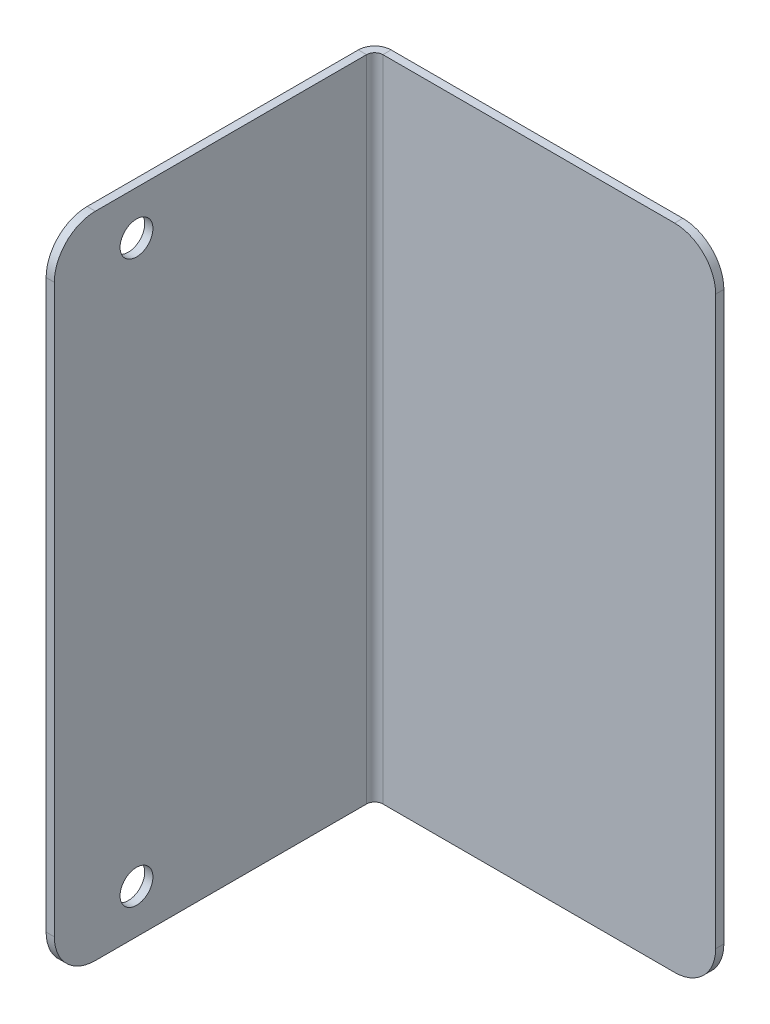
ISO-10303-21;
HEADER;
FILE_DESCRIPTION(('STEP AP214'),'2;1');
FILE_NAME('part.step','',(''),(''),'','','');
FILE_SCHEMA(('AUTOMOTIVE_DESIGN { 1 0 10303 214 1 1 1 1 }'));
ENDSEC;
DATA;
#1=APPLICATION_CONTEXT('core data for automotive mechanical design processes');
#2=APPLICATION_PROTOCOL_DEFINITION('international standard','automotive_design',2000,#1);
#3=PRODUCT_CONTEXT('',#1,'mechanical');
#4=PRODUCT('Part','Part','',(#3));
#5=PRODUCT_RELATED_PRODUCT_CATEGORY('part','',(#4));
#6=PRODUCT_DEFINITION_FORMATION('','',#4);
#7=PRODUCT_DEFINITION_CONTEXT('part definition',#1,'design');
#8=PRODUCT_DEFINITION('design','',#6,#7);
#9=PRODUCT_DEFINITION_SHAPE('','',#8);
#10=(LENGTH_UNIT() NAMED_UNIT(*) SI_UNIT(.MILLI.,.METRE.));
#11=(NAMED_UNIT(*) PLANE_ANGLE_UNIT() SI_UNIT($,.RADIAN.));
#12=(NAMED_UNIT(*) SI_UNIT($,.STERADIAN.) SOLID_ANGLE_UNIT());
#13=UNCERTAINTY_MEASURE_WITH_UNIT(LENGTH_MEASURE(1.E-05),#10,'distance_accuracy_value','');
#14=(GEOMETRIC_REPRESENTATION_CONTEXT(3) GLOBAL_UNCERTAINTY_ASSIGNED_CONTEXT((#13)) GLOBAL_UNIT_ASSIGNED_CONTEXT((#10,
#11,#12)) REPRESENTATION_CONTEXT('',''));
#15=CARTESIAN_POINT('',(0.,0.,0.));
#16=DIRECTION('',(0.,0.,1.));
#17=DIRECTION('',(1.,0.,0.));
#18=AXIS2_PLACEMENT_3D('',#15,#16,#17);
#19=CARTESIAN_POINT('',(254.5,935.,360.));
#20=DIRECTION('',(-1.,0.,0.));
#21=DIRECTION('',(0.,0.,1.));
#22=AXIS2_PLACEMENT_3D('',#19,#20,#21);
#23=CYLINDRICAL_SURFACE('',#22,10.);
#24=DIRECTION('',(1.,0.,0.));
#25=VECTOR('',#24,1.);
#26=CARTESIAN_POINT('',(254.5,945.,360.));
#27=LINE('',#26,#25);
#28=CARTESIAN_POINT('',(252.5,945.,360.));
#29=VERTEX_POINT('',#28);
#30=CARTESIAN_POINT('',(254.5,945.,360.));
#31=VERTEX_POINT('',#30);
#32=EDGE_CURVE('E11',#29,#31,#27,.T.);
#33=ORIENTED_EDGE('',*,*,#32,.F.);
#34=CARTESIAN_POINT('',(252.5,935.,360.));
#35=DIRECTION('',(-1.,0.,0.));
#36=DIRECTION('',(0.,0.,1.));
#37=AXIS2_PLACEMENT_3D('',#34,#35,#36);
#38=CIRCLE('',#37,10.);
#39=CARTESIAN_POINT('',(252.5,935.,370.));
#40=VERTEX_POINT('',#39);
#41=EDGE_CURVE('E97',#29,#40,#38,.F.);
#42=ORIENTED_EDGE('',*,*,#41,.T.);
#43=DIRECTION('',(1.,0.,0.));
#44=VECTOR('',#43,1.);
#45=CARTESIAN_POINT('',(254.5,935.,370.));
#46=LINE('',#45,#44);
#47=CARTESIAN_POINT('',(254.5,935.,370.));
#48=VERTEX_POINT('',#47);
#49=EDGE_CURVE('E47',#40,#48,#46,.T.);
#50=ORIENTED_EDGE('',*,*,#49,.T.);
#51=CARTESIAN_POINT('',(254.5,935.,360.));
#52=DIRECTION('',(-1.,0.,0.));
#53=DIRECTION('',(0.,0.,1.));
#54=AXIS2_PLACEMENT_3D('',#51,#52,#53);
#55=CIRCLE('',#54,10.);
#56=EDGE_CURVE('E100',#31,#48,#55,.F.);
#57=ORIENTED_EDGE('',*,*,#56,.F.);
#58=EDGE_LOOP('',(#33,#42,#50,#57));
#59=FACE_BOUND('',#58,.T.);
#60=ADVANCED_FACE('F37',(#59),#23,.T.);
#61=CARTESIAN_POINT('',(254.5,787.,370.));
#62=DIRECTION('',(0.,0.,1.));
#63=DIRECTION('',(0.,1.,0.));
#64=AXIS2_PLACEMENT_3D('',#61,#62,#63);
#65=PLANE('',#64);
#66=ORIENTED_EDGE('',*,*,#49,.F.);
#67=DIRECTION('',(0.,1.,0.));
#68=VECTOR('',#67,1.);
#69=CARTESIAN_POINT('',(252.5,0.,370.));
#70=LINE('',#69,#68);
#71=CARTESIAN_POINT('',(252.5,797.,370.));
#72=VERTEX_POINT('',#71);
#73=EDGE_CURVE('E113',#72,#40,#70,.T.);
#74=ORIENTED_EDGE('',*,*,#73,.F.);
#75=DIRECTION('',(1.,0.,0.));
#76=VECTOR('',#75,1.);
#77=CARTESIAN_POINT('',(254.5,797.,370.));
#78=LINE('',#77,#76);
#79=CARTESIAN_POINT('',(254.5,797.,370.));
#80=VERTEX_POINT('',#79);
#81=EDGE_CURVE('E150',#72,#80,#78,.T.);
#82=ORIENTED_EDGE('',*,*,#81,.T.);
#83=DIRECTION('',(0.,1.,0.));
#84=VECTOR('',#83,1.);
#85=CARTESIAN_POINT('',(254.5,787.,370.));
#86=LINE('',#85,#84);
#87=EDGE_CURVE('E162',#80,#48,#86,.T.);
#88=ORIENTED_EDGE('',*,*,#87,.T.);
#89=EDGE_LOOP('',(#66,#74,#82,#88));
#90=FACE_BOUND('',#89,.T.);
#91=ADVANCED_FACE('F167',(#90),#65,.T.);
#92=CARTESIAN_POINT('',(254.5,797.,360.));
#93=DIRECTION('',(-1.,0.,0.));
#94=DIRECTION('',(0.,0.,1.));
#95=AXIS2_PLACEMENT_3D('',#92,#93,#94);
#96=CYLINDRICAL_SURFACE('',#95,10.);
#97=ORIENTED_EDGE('',*,*,#81,.F.);
#98=CARTESIAN_POINT('',(252.5,797.,360.));
#99=DIRECTION('',(-1.,0.,0.));
#100=DIRECTION('',(0.,0.,1.));
#101=AXIS2_PLACEMENT_3D('',#98,#99,#100);
#102=CIRCLE('',#101,10.);
#103=CARTESIAN_POINT('',(252.5,787.,360.));
#104=VERTEX_POINT('',#103);
#105=EDGE_CURVE('E212',#72,#104,#102,.F.);
#106=ORIENTED_EDGE('',*,*,#105,.T.);
#107=DIRECTION('',(1.,0.,0.));
#108=VECTOR('',#107,1.);
#109=CARTESIAN_POINT('',(254.5,787.,360.));
#110=LINE('',#109,#108);
#111=CARTESIAN_POINT('',(254.5,787.,360.));
#112=VERTEX_POINT('',#111);
#113=EDGE_CURVE('E147',#104,#112,#110,.T.);
#114=ORIENTED_EDGE('',*,*,#113,.T.);
#115=CARTESIAN_POINT('',(254.5,797.,360.));
#116=DIRECTION('',(-1.,0.,0.));
#117=DIRECTION('',(0.,0.,1.));
#118=AXIS2_PLACEMENT_3D('',#115,#116,#117);
#119=CIRCLE('',#118,10.);
#120=EDGE_CURVE('E168',#80,#112,#119,.F.);
#121=ORIENTED_EDGE('',*,*,#120,.F.);
#122=EDGE_LOOP('',(#97,#106,#114,#121));
#123=FACE_BOUND('',#122,.T.);
#124=ADVANCED_FACE('F215',(#123),#96,.T.);
#125=CARTESIAN_POINT('',(254.5,787.,292.));
#126=DIRECTION('',(0.,-1.,0.));
#127=DIRECTION('',(0.,0.,1.));
#128=AXIS2_PLACEMENT_3D('',#125,#126,#127);
#129=PLANE('',#128);
#130=ORIENTED_EDGE('',*,*,#113,.F.);
#131=DIRECTION('',(0.,0.,1.));
#132=VECTOR('',#131,1.);
#133=CARTESIAN_POINT('',(252.500000000001,787.,8.91380986117316E-13));
#134=LINE('',#133,#132);
#135=CARTESIAN_POINT('',(252.5,787.,294.));
#136=VERTEX_POINT('',#135);
#137=EDGE_CURVE('E190',#136,#104,#134,.T.);
#138=ORIENTED_EDGE('',*,*,#137,.F.);
#139=DIRECTION('',(1.,0.,0.));
#140=VECTOR('',#139,1.);
#141=CARTESIAN_POINT('',(254.5,787.,294.));
#142=LINE('',#141,#140);
#143=CARTESIAN_POINT('',(254.5,787.,294.));
#144=VERTEX_POINT('',#143);
#145=EDGE_CURVE('E145',#136,#144,#142,.T.);
#146=ORIENTED_EDGE('',*,*,#145,.T.);
#147=DIRECTION('',(0.,0.,1.));
#148=VECTOR('',#147,1.);
#149=CARTESIAN_POINT('',(254.5,787.,292.));
#150=LINE('',#149,#148);
#151=EDGE_CURVE('E170',#144,#112,#150,.T.);
#152=ORIENTED_EDGE('',*,*,#151,.T.);
#153=EDGE_LOOP('',(#130,#138,#146,#152));
#154=FACE_BOUND('',#153,.T.);
#155=ADVANCED_FACE('F219',(#154),#129,.T.);
#156=CARTESIAN_POINT('',(256.5,787.,294.));
#157=DIRECTION('',(0.,1.,0.));
#158=DIRECTION('',(0.,0.,1.));
#159=AXIS2_PLACEMENT_3D('',#156,#157,#158);
#160=PLANE('',#159);
#161=ORIENTED_EDGE('',*,*,#145,.F.);
#162=CARTESIAN_POINT('',(256.5,787.,294.));
#163=DIRECTION('',(0.,-1.,0.));
#164=DIRECTION('',(0.,0.,-1.));
#165=AXIS2_PLACEMENT_3D('',#162,#163,#164);
#166=CIRCLE('',#165,4.);
#167=CARTESIAN_POINT('',(256.5,787.,290.));
#168=VERTEX_POINT('',#167);
#169=EDGE_CURVE('E192',#136,#168,#166,.T.);
#170=ORIENTED_EDGE('',*,*,#169,.T.);
#171=DIRECTION('',(0.,0.,1.));
#172=VECTOR('',#171,1.);
#173=CARTESIAN_POINT('',(256.5,787.,292.));
#174=LINE('',#173,#172);
#175=CARTESIAN_POINT('',(256.5,787.,292.));
#176=VERTEX_POINT('',#175);
#177=EDGE_CURVE('E142',#168,#176,#174,.T.);
#178=ORIENTED_EDGE('',*,*,#177,.T.);
#179=CARTESIAN_POINT('',(256.5,787.,294.));
#180=DIRECTION('',(0.,-1.,0.));
#181=DIRECTION('',(0.,0.,-1.));
#182=AXIS2_PLACEMENT_3D('',#179,#180,#181);
#183=CIRCLE('',#182,2.);
#184=EDGE_CURVE('E181',#144,#176,#183,.T.);
#185=ORIENTED_EDGE('',*,*,#184,.F.);
#186=EDGE_LOOP('',(#161,#170,#178,#185));
#187=FACE_BOUND('',#186,.T.);
#188=ADVANCED_FACE('F226',(#187),#160,.F.);
#189=CARTESIAN_POINT('',(252.5,787.,292.));
#190=DIRECTION('',(0.,1.,0.));
#191=DIRECTION('',(-1.,0.,0.));
#192=AXIS2_PLACEMENT_3D('',#189,#190,#191);
#193=PLANE('',#192);
#194=ORIENTED_EDGE('',*,*,#177,.F.);
#195=DIRECTION('',(1.,0.,0.));
#196=VECTOR('',#195,1.);
#197=CARTESIAN_POINT('',(0.,787.,290.));
#198=LINE('',#197,#196);
#199=CARTESIAN_POINT('',(327.5,787.,290.));
#200=VERTEX_POINT('',#199);
#201=EDGE_CURVE('E204',#200,#168,#198,.F.);
#202=ORIENTED_EDGE('',*,*,#201,.F.);
#203=DIRECTION('',(0.,0.,1.));
#204=VECTOR('',#203,1.);
#205=CARTESIAN_POINT('',(327.5,787.,292.));
#206=LINE('',#205,#204);
#207=CARTESIAN_POINT('',(327.5,787.,292.));
#208=VERTEX_POINT('',#207);
#209=EDGE_CURVE('E139',#200,#208,#206,.T.);
#210=ORIENTED_EDGE('',*,*,#209,.T.);
#211=DIRECTION('',(-1.,0.,0.));
#212=VECTOR('',#211,1.);
#213=CARTESIAN_POINT('',(252.5,787.,292.));
#214=LINE('',#213,#212);
#215=EDGE_CURVE('E209',#208,#176,#214,.T.);
#216=ORIENTED_EDGE('',*,*,#215,.T.);
#217=EDGE_LOOP('',(#194,#202,#210,#216));
#218=FACE_BOUND('',#217,.T.);
#219=ADVANCED_FACE('F250',(#218),#193,.F.);
#220=CARTESIAN_POINT('',(327.5,797.,292.));
#221=DIRECTION('',(0.,0.,1.));
#222=DIRECTION('',(1.,0.,0.));
#223=AXIS2_PLACEMENT_3D('',#220,#221,#222);
#224=CYLINDRICAL_SURFACE('',#223,10.);
#225=ORIENTED_EDGE('',*,*,#209,.F.);
#226=CARTESIAN_POINT('',(327.5,797.,290.));
#227=DIRECTION('',(0.,0.,1.));
#228=DIRECTION('',(1.,0.,0.));
#229=AXIS2_PLACEMENT_3D('',#226,#227,#228);
#230=CIRCLE('',#229,10.);
#231=CARTESIAN_POINT('',(337.5,797.,290.));
#232=VERTEX_POINT('',#231);
#233=EDGE_CURVE('E201',#200,#232,#230,.T.);
#234=ORIENTED_EDGE('',*,*,#233,.T.);
#235=DIRECTION('',(0.,0.,1.));
#236=VECTOR('',#235,1.);
#237=CARTESIAN_POINT('',(337.5,797.,292.));
#238=LINE('',#237,#236);
#239=CARTESIAN_POINT('',(337.5,797.,292.));
#240=VERTEX_POINT('',#239);
#241=EDGE_CURVE('E136',#232,#240,#238,.T.);
#242=ORIENTED_EDGE('',*,*,#241,.T.);
#243=CARTESIAN_POINT('',(327.5,797.,292.));
#244=DIRECTION('',(0.,0.,1.));
#245=DIRECTION('',(1.,0.,0.));
#246=AXIS2_PLACEMENT_3D('',#243,#244,#245);
#247=CIRCLE('',#246,10.);
#248=EDGE_CURVE('E258',#208,#240,#247,.T.);
#249=ORIENTED_EDGE('',*,*,#248,.F.);
#250=EDGE_LOOP('',(#225,#234,#242,#249));
#251=FACE_BOUND('',#250,.T.);
#252=ADVANCED_FACE('F263',(#251),#224,.T.);
#253=CARTESIAN_POINT('',(337.5,945.,292.));
#254=DIRECTION('',(-1.,0.,0.));
#255=DIRECTION('',(0.,-1.,0.));
#256=AXIS2_PLACEMENT_3D('',#253,#254,#255);
#257=PLANE('',#256);
#258=ORIENTED_EDGE('',*,*,#241,.F.);
#259=DIRECTION('',(0.,1.,0.));
#260=VECTOR('',#259,1.);
#261=CARTESIAN_POINT('',(337.5,0.,290.));
#262=LINE('',#261,#260);
#263=CARTESIAN_POINT('',(337.5,935.,290.));
#264=VERTEX_POINT('',#263);
#265=EDGE_CURVE('E198',#264,#232,#262,.F.);
#266=ORIENTED_EDGE('',*,*,#265,.F.);
#267=DIRECTION('',(0.,0.,1.));
#268=VECTOR('',#267,1.);
#269=CARTESIAN_POINT('',(337.5,935.,292.));
#270=LINE('',#269,#268);
#271=CARTESIAN_POINT('',(337.5,935.,292.));
#272=VERTEX_POINT('',#271);
#273=EDGE_CURVE('E133',#264,#272,#270,.T.);
#274=ORIENTED_EDGE('',*,*,#273,.T.);
#275=DIRECTION('',(0.,-1.,0.));
#276=VECTOR('',#275,1.);
#277=CARTESIAN_POINT('',(337.5,945.,292.));
#278=LINE('',#277,#276);
#279=EDGE_CURVE('E264',#272,#240,#278,.T.);
#280=ORIENTED_EDGE('',*,*,#279,.T.);
#281=EDGE_LOOP('',(#258,#266,#274,#280));
#282=FACE_BOUND('',#281,.T.);
#283=ADVANCED_FACE('F335',(#282),#257,.F.);
#284=CARTESIAN_POINT('',(327.5,935.,292.));
#285=DIRECTION('',(0.,0.,1.));
#286=DIRECTION('',(1.,0.,0.));
#287=AXIS2_PLACEMENT_3D('',#284,#285,#286);
#288=CYLINDRICAL_SURFACE('',#287,10.);
#289=ORIENTED_EDGE('',*,*,#273,.F.);
#290=CARTESIAN_POINT('',(327.5,935.,290.));
#291=DIRECTION('',(0.,0.,1.));
#292=DIRECTION('',(1.,0.,0.));
#293=AXIS2_PLACEMENT_3D('',#290,#291,#292);
#294=CIRCLE('',#293,10.);
#295=CARTESIAN_POINT('',(327.5,945.,290.));
#296=VERTEX_POINT('',#295);
#297=EDGE_CURVE('E195',#264,#296,#294,.T.);
#298=ORIENTED_EDGE('',*,*,#297,.T.);
#299=DIRECTION('',(0.,0.,1.));
#300=VECTOR('',#299,1.);
#301=CARTESIAN_POINT('',(327.5,945.,292.));
#302=LINE('',#301,#300);
#303=CARTESIAN_POINT('',(327.5,945.,292.));
#304=VERTEX_POINT('',#303);
#305=EDGE_CURVE('E130',#296,#304,#302,.T.);
#306=ORIENTED_EDGE('',*,*,#305,.T.);
#307=CARTESIAN_POINT('',(327.5,935.,292.));
#308=DIRECTION('',(0.,0.,1.));
#309=DIRECTION('',(1.,0.,0.));
#310=AXIS2_PLACEMENT_3D('',#307,#308,#309);
#311=CIRCLE('',#310,10.);
#312=EDGE_CURVE('E266',#272,#304,#311,.T.);
#313=ORIENTED_EDGE('',*,*,#312,.F.);
#314=EDGE_LOOP('',(#289,#298,#306,#313));
#315=FACE_BOUND('',#314,.T.);
#316=ADVANCED_FACE('F331',(#315),#288,.T.);
#317=CARTESIAN_POINT('',(252.5,945.,292.));
#318=DIRECTION('',(0.,-1.,0.));
#319=DIRECTION('',(1.,0.,0.));
#320=AXIS2_PLACEMENT_3D('',#317,#318,#319);
#321=PLANE('',#320);
#322=ORIENTED_EDGE('',*,*,#305,.F.);
#323=DIRECTION('',(1.,0.,0.));
#324=VECTOR('',#323,1.);
#325=CARTESIAN_POINT('',(0.,945.,290.));
#326=LINE('',#325,#324);
#327=CARTESIAN_POINT('',(256.5,945.,290.));
#328=VERTEX_POINT('',#327);
#329=EDGE_CURVE('E186',#328,#296,#326,.T.);
#330=ORIENTED_EDGE('',*,*,#329,.F.);
#331=DIRECTION('',(0.,0.,1.));
#332=VECTOR('',#331,1.);
#333=CARTESIAN_POINT('',(256.5,945.,292.));
#334=LINE('',#333,#332);
#335=CARTESIAN_POINT('',(256.5,945.,292.));
#336=VERTEX_POINT('',#335);
#337=EDGE_CURVE('E127',#328,#336,#334,.T.);
#338=ORIENTED_EDGE('',*,*,#337,.T.);
#339=DIRECTION('',(1.,0.,0.));
#340=VECTOR('',#339,1.);
#341=CARTESIAN_POINT('',(252.5,945.,292.));
#342=LINE('',#341,#340);
#343=EDGE_CURVE('E271',#336,#304,#342,.T.);
#344=ORIENTED_EDGE('',*,*,#343,.T.);
#345=EDGE_LOOP('',(#322,#330,#338,#344));
#346=FACE_BOUND('',#345,.T.);
#347=ADVANCED_FACE('F311',(#346),#321,.F.);
#348=CARTESIAN_POINT('',(256.5,945.,294.));
#349=DIRECTION('',(0.,1.,0.));
#350=DIRECTION('',(0.,0.,1.));
#351=AXIS2_PLACEMENT_3D('',#348,#349,#350);
#352=PLANE('',#351);
#353=ORIENTED_EDGE('',*,*,#337,.F.);
#354=CARTESIAN_POINT('',(256.5,945.,294.));
#355=DIRECTION('',(0.,-1.,0.));
#356=DIRECTION('',(0.,0.,-1.));
#357=AXIS2_PLACEMENT_3D('',#354,#355,#356);
#358=CIRCLE('',#357,4.);
#359=CARTESIAN_POINT('',(252.5,945.,294.));
#360=VERTEX_POINT('',#359);
#361=EDGE_CURVE('E189',#328,#360,#358,.F.);
#362=ORIENTED_EDGE('',*,*,#361,.T.);
#363=DIRECTION('',(1.,0.,0.));
#364=VECTOR('',#363,1.);
#365=CARTESIAN_POINT('',(254.5,945.,294.));
#366=LINE('',#365,#364);
#367=CARTESIAN_POINT('',(254.5,945.,294.));
#368=VERTEX_POINT('',#367);
#369=EDGE_CURVE('E41',#360,#368,#366,.T.);
#370=ORIENTED_EDGE('',*,*,#369,.T.);
#371=CARTESIAN_POINT('',(256.5,945.,294.));
#372=DIRECTION('',(0.,-1.,0.));
#373=DIRECTION('',(0.,0.,-1.));
#374=AXIS2_PLACEMENT_3D('',#371,#372,#373);
#375=CIRCLE('',#374,2.);
#376=EDGE_CURVE('E179',#336,#368,#375,.F.);
#377=ORIENTED_EDGE('',*,*,#376,.F.);
#378=EDGE_LOOP('',(#353,#362,#370,#377));
#379=FACE_BOUND('',#378,.T.);
#380=ADVANCED_FACE('F305',(#379),#352,.T.);
#381=CARTESIAN_POINT('',(254.5,934.35,350.));
#382=DIRECTION('',(-1.,0.,0.));
#383=DIRECTION('',(0.,0.,1.));
#384=AXIS2_PLACEMENT_3D('',#381,#382,#383);
#385=CYLINDRICAL_SURFACE('',#384,3.99999999999999);
#386=CARTESIAN_POINT('',(254.5,934.35,350.));
#387=DIRECTION('',(1.,0.,0.));
#388=DIRECTION('',(0.,0.,-1.));
#389=AXIS2_PLACEMENT_3D('',#386,#387,#388);
#390=CIRCLE('',#389,3.99999999999999);
#391=CARTESIAN_POINT('',(254.5,934.35,346.));
#392=VERTEX_POINT('',#391);
#393=EDGE_CURVE('E275',#392,#392,#390,.T.);
#394=ORIENTED_EDGE('',*,*,#393,.T.);
#395=EDGE_LOOP('',(#394));
#396=FACE_BOUND('',#395,.T.);
#397=CARTESIAN_POINT('',(252.5,934.35,350.));
#398=DIRECTION('',(1.,0.,0.));
#399=DIRECTION('',(0.,0.,-1.));
#400=AXIS2_PLACEMENT_3D('',#397,#398,#399);
#401=CIRCLE('',#400,3.99999999999999);
#402=CARTESIAN_POINT('',(252.5,934.35,346.));
#403=VERTEX_POINT('',#402);
#404=EDGE_CURVE('E120',#403,#403,#401,.T.);
#405=ORIENTED_EDGE('',*,*,#404,.F.);
#406=EDGE_LOOP('',(#405));
#407=FACE_BOUND('',#406,.T.);
#408=ADVANCED_FACE('F303',(#396,#407),#385,.F.);
#409=CARTESIAN_POINT('',(254.5,797.65,350.));
#410=DIRECTION('',(-1.,0.,0.));
#411=DIRECTION('',(0.,0.,1.));
#412=AXIS2_PLACEMENT_3D('',#409,#410,#411);
#413=CYLINDRICAL_SURFACE('',#412,3.99999999999999);
#414=CARTESIAN_POINT('',(254.5,797.65,350.));
#415=DIRECTION('',(1.,0.,0.));
#416=DIRECTION('',(0.,0.,-1.));
#417=AXIS2_PLACEMENT_3D('',#414,#415,#416);
#418=CIRCLE('',#417,3.99999999999999);
#419=CARTESIAN_POINT('',(254.5,797.65,346.));
#420=VERTEX_POINT('',#419);
#421=EDGE_CURVE('E278',#420,#420,#418,.T.);
#422=ORIENTED_EDGE('',*,*,#421,.T.);
#423=EDGE_LOOP('',(#422));
#424=FACE_BOUND('',#423,.T.);
#425=CARTESIAN_POINT('',(252.5,797.65,350.));
#426=DIRECTION('',(1.,0.,0.));
#427=DIRECTION('',(0.,0.,-1.));
#428=AXIS2_PLACEMENT_3D('',#425,#426,#427);
#429=CIRCLE('',#428,3.99999999999999);
#430=CARTESIAN_POINT('',(252.5,797.65,346.));
#431=VERTEX_POINT('',#430);
#432=EDGE_CURVE('E117',#431,#431,#429,.T.);
#433=ORIENTED_EDGE('',*,*,#432,.F.);
#434=EDGE_LOOP('',(#433));
#435=FACE_BOUND('',#434,.T.);
#436=ADVANCED_FACE('F39',(#424,#435),#413,.F.);
#437=CARTESIAN_POINT('',(254.5,945.,370.));
#438=DIRECTION('',(0.,1.,0.));
#439=DIRECTION('',(0.,0.,-1.));
#440=AXIS2_PLACEMENT_3D('',#437,#438,#439);
#441=PLANE('',#440);
#442=DIRECTION('',(0.,0.,1.));
#443=VECTOR('',#442,1.);
#444=CARTESIAN_POINT('',(252.500000000001,945.,8.91380986117316E-13));
#445=LINE('',#444,#443);
#446=EDGE_CURVE('E110',#29,#360,#445,.F.);
#447=ORIENTED_EDGE('',*,*,#446,.F.);
#448=ORIENTED_EDGE('',*,*,#32,.T.);
#449=DIRECTION('',(0.,0.,-1.));
#450=VECTOR('',#449,1.);
#451=CARTESIAN_POINT('',(254.5,945.,370.));
#452=LINE('',#451,#450);
#453=EDGE_CURVE('E165',#31,#368,#452,.T.);
#454=ORIENTED_EDGE('',*,*,#453,.T.);
#455=ORIENTED_EDGE('',*,*,#369,.F.);
#456=EDGE_LOOP('',(#447,#448,#454,#455));
#457=FACE_BOUND('',#456,.T.);
#458=ADVANCED_FACE('F115',(#457),#441,.T.);
#459=CARTESIAN_POINT('',(256.5,787.,294.));
#460=DIRECTION('',(0.,-1.,0.));
#461=DIRECTION('',(-1.,0.,0.));
#462=AXIS2_PLACEMENT_3D('',#459,#460,#461);
#463=CYLINDRICAL_SURFACE('',#462,2.);
#464=DIRECTION('',(0.,-1.,0.));
#465=VECTOR('',#464,1.);
#466=CARTESIAN_POINT('',(256.5,787.,292.));
#467=LINE('',#466,#465);
#468=EDGE_CURVE('E261',#176,#336,#467,.F.);
#469=ORIENTED_EDGE('',*,*,#468,.T.);
#470=ORIENTED_EDGE('',*,*,#376,.T.);
#471=DIRECTION('',(0.,1.,0.));
#472=VECTOR('',#471,1.);
#473=CARTESIAN_POINT('',(254.5,945.,294.));
#474=LINE('',#473,#472);
#475=EDGE_CURVE('E176',#368,#144,#474,.F.);
#476=ORIENTED_EDGE('',*,*,#475,.T.);
#477=ORIENTED_EDGE('',*,*,#184,.T.);
#478=EDGE_LOOP('',(#469,#470,#476,#477));
#479=FACE_BOUND('',#478,.T.);
#480=ADVANCED_FACE('F233',(#479),#463,.F.);
#481=CARTESIAN_POINT('',(254.500000000001,0.,8.98497800377734E-13));
#482=DIRECTION('',(-1.,0.,0.));
#483=DIRECTION('',(0.,0.,1.));
#484=AXIS2_PLACEMENT_3D('',#481,#482,#483);
#485=PLANE('',#484);
#486=ORIENTED_EDGE('',*,*,#393,.F.);
#487=EDGE_LOOP('',(#486));
#488=FACE_BOUND('',#487,.T.);
#489=ORIENTED_EDGE('',*,*,#421,.F.);
#490=EDGE_LOOP('',(#489));
#491=FACE_BOUND('',#490,.T.);
#492=ORIENTED_EDGE('',*,*,#453,.F.);
#493=ORIENTED_EDGE('',*,*,#56,.T.);
#494=ORIENTED_EDGE('',*,*,#87,.F.);
#495=ORIENTED_EDGE('',*,*,#120,.T.);
#496=ORIENTED_EDGE('',*,*,#151,.F.);
#497=ORIENTED_EDGE('',*,*,#475,.F.);
#498=EDGE_LOOP('',(#492,#493,#494,#495,#496,#497));
#499=FACE_BOUND('',#498,.T.);
#500=ADVANCED_FACE('F160',(#488,#491,#499),#485,.F.);
#501=CARTESIAN_POINT('',(0.,0.,292.));
#502=DIRECTION('',(0.,0.,1.));
#503=DIRECTION('',(1.,0.,0.));
#504=AXIS2_PLACEMENT_3D('',#501,#502,#503);
#505=PLANE('',#504);
#506=ORIENTED_EDGE('',*,*,#215,.F.);
#507=ORIENTED_EDGE('',*,*,#248,.T.);
#508=ORIENTED_EDGE('',*,*,#279,.F.);
#509=ORIENTED_EDGE('',*,*,#312,.T.);
#510=ORIENTED_EDGE('',*,*,#343,.F.);
#511=ORIENTED_EDGE('',*,*,#468,.F.);
#512=EDGE_LOOP('',(#506,#507,#508,#509,#510,#511));
#513=FACE_BOUND('',#512,.T.);
#514=ADVANCED_FACE('F256',(#513),#505,.T.);
#515=CARTESIAN_POINT('',(256.5,787.,294.));
#516=DIRECTION('',(0.,-1.,0.));
#517=DIRECTION('',(-1.,0.,0.));
#518=AXIS2_PLACEMENT_3D('',#515,#516,#517);
#519=CYLINDRICAL_SURFACE('',#518,4.);
#520=DIRECTION('',(0.,-1.,0.));
#521=VECTOR('',#520,1.);
#522=CARTESIAN_POINT('',(256.5,787.,290.));
#523=LINE('',#522,#521);
#524=EDGE_CURVE('E125',#168,#328,#523,.F.);
#525=ORIENTED_EDGE('',*,*,#524,.F.);
#526=ORIENTED_EDGE('',*,*,#169,.F.);
#527=DIRECTION('',(0.,-1.,0.));
#528=VECTOR('',#527,1.);
#529=CARTESIAN_POINT('',(252.5,787.,294.));
#530=LINE('',#529,#528);
#531=EDGE_CURVE('E187',#360,#136,#530,.T.);
#532=ORIENTED_EDGE('',*,*,#531,.F.);
#533=ORIENTED_EDGE('',*,*,#361,.F.);
#534=EDGE_LOOP('',(#525,#526,#532,#533));
#535=FACE_BOUND('',#534,.T.);
#536=ADVANCED_FACE('F223',(#535),#519,.T.);
#537=CARTESIAN_POINT('',(252.500000000001,0.,8.91380986117316E-13));
#538=DIRECTION('',(-1.,0.,0.));
#539=DIRECTION('',(0.,0.,1.));
#540=AXIS2_PLACEMENT_3D('',#537,#538,#539);
#541=PLANE('',#540);
#542=ORIENTED_EDGE('',*,*,#404,.T.);
#543=EDGE_LOOP('',(#542));
#544=FACE_BOUND('',#543,.T.);
#545=ORIENTED_EDGE('',*,*,#432,.T.);
#546=EDGE_LOOP('',(#545));
#547=FACE_BOUND('',#546,.T.);
#548=ORIENTED_EDGE('',*,*,#446,.T.);
#549=ORIENTED_EDGE('',*,*,#531,.T.);
#550=ORIENTED_EDGE('',*,*,#137,.T.);
#551=ORIENTED_EDGE('',*,*,#105,.F.);
#552=ORIENTED_EDGE('',*,*,#73,.T.);
#553=ORIENTED_EDGE('',*,*,#41,.F.);
#554=EDGE_LOOP('',(#548,#549,#550,#551,#552,#553));
#555=FACE_BOUND('',#554,.T.);
#556=ADVANCED_FACE('F108',(#544,#547,#555),#541,.T.);
#557=CARTESIAN_POINT('',(0.,0.,290.));
#558=DIRECTION('',(0.,0.,1.));
#559=DIRECTION('',(1.,0.,0.));
#560=AXIS2_PLACEMENT_3D('',#557,#558,#559);
#561=PLANE('',#560);
#562=ORIENTED_EDGE('',*,*,#201,.T.);
#563=ORIENTED_EDGE('',*,*,#524,.T.);
#564=ORIENTED_EDGE('',*,*,#329,.T.);
#565=ORIENTED_EDGE('',*,*,#297,.F.);
#566=ORIENTED_EDGE('',*,*,#265,.T.);
#567=ORIENTED_EDGE('',*,*,#233,.F.);
#568=EDGE_LOOP('',(#562,#563,#564,#565,#566,#567));
#569=FACE_BOUND('',#568,.T.);
#570=ADVANCED_FACE('F318',(#569),#561,.F.);
#571=CLOSED_SHELL('',(#60,#91,#124,#155,#188,#219,#252,#283,#316,#347,#380,#408,#436,#458,#480,
#500,#514,#536,#556,#570));
#572=MANIFOLD_SOLID_BREP('B2',#571);
#573=ADVANCED_BREP_SHAPE_REPRESENTATION('',(#18,#572),#14);
#574=SHAPE_DEFINITION_REPRESENTATION(#9,#573);
ENDSEC;
END-ISO-10303-21;
